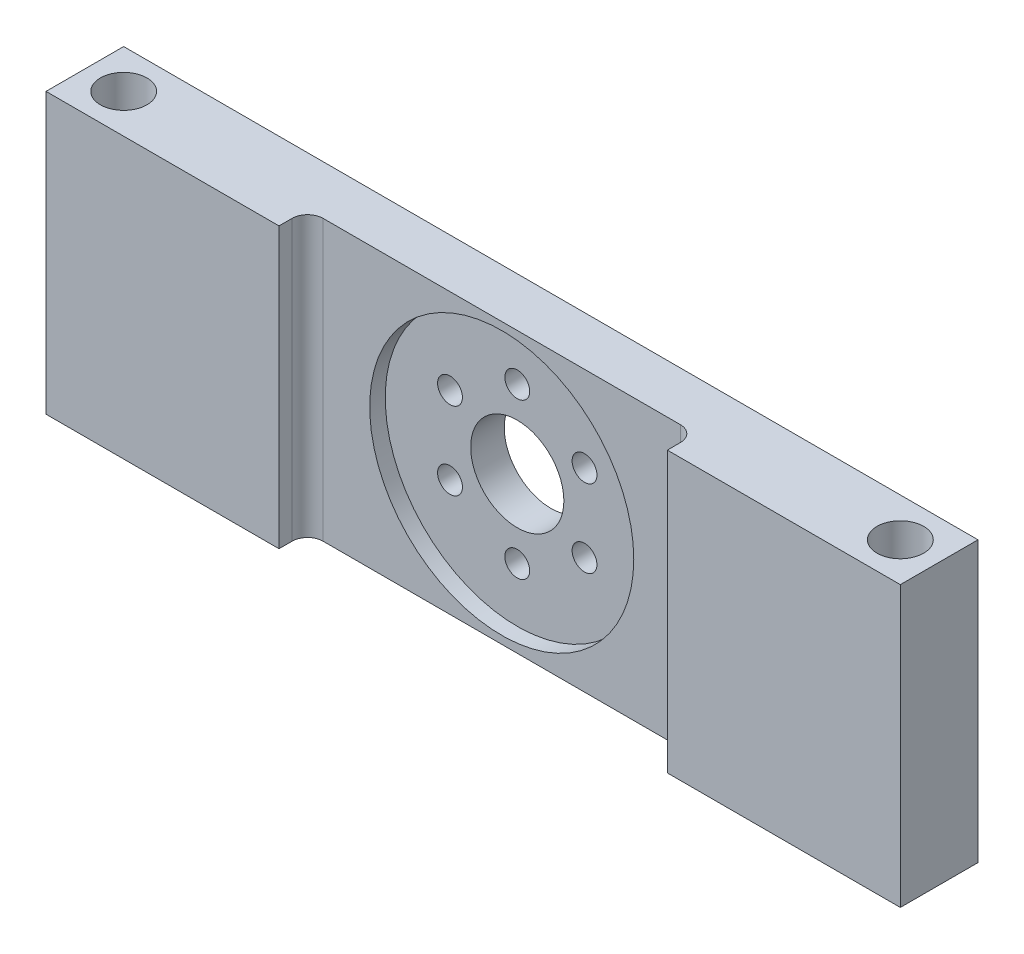
ISO-10303-21;
HEADER;
FILE_DESCRIPTION(('STEP AP214'),'2;1');
FILE_NAME('part.step','',(''),(''),'','','');
FILE_SCHEMA(('AUTOMOTIVE_DESIGN { 1 0 10303 214 1 1 1 1 }'));
ENDSEC;
DATA;
#1=APPLICATION_CONTEXT('core data for automotive mechanical design processes');
#2=APPLICATION_PROTOCOL_DEFINITION('international standard','automotive_design',2000,#1);
#3=PRODUCT_CONTEXT('',#1,'mechanical');
#4=PRODUCT('Part','Part','',(#3));
#5=PRODUCT_RELATED_PRODUCT_CATEGORY('part','',(#4));
#6=PRODUCT_DEFINITION_FORMATION('','',#4);
#7=PRODUCT_DEFINITION_CONTEXT('part definition',#1,'design');
#8=PRODUCT_DEFINITION('design','',#6,#7);
#9=PRODUCT_DEFINITION_SHAPE('','',#8);
#10=(LENGTH_UNIT() NAMED_UNIT(*) SI_UNIT(.MILLI.,.METRE.));
#11=(NAMED_UNIT(*) PLANE_ANGLE_UNIT() SI_UNIT($,.RADIAN.));
#12=(NAMED_UNIT(*) SI_UNIT($,.STERADIAN.) SOLID_ANGLE_UNIT());
#13=UNCERTAINTY_MEASURE_WITH_UNIT(LENGTH_MEASURE(1.E-05),#10,'distance_accuracy_value','');
#14=(GEOMETRIC_REPRESENTATION_CONTEXT(3) GLOBAL_UNCERTAINTY_ASSIGNED_CONTEXT((#13)) GLOBAL_UNIT_ASSIGNED_CONTEXT((#10,
#11,#12)) REPRESENTATION_CONTEXT('',''));
#15=CARTESIAN_POINT('',(0.,0.,0.));
#16=DIRECTION('',(0.,0.,1.));
#17=DIRECTION('',(1.,0.,0.));
#18=AXIS2_PLACEMENT_3D('',#15,#16,#17);
#19=CARTESIAN_POINT('',(-18.9402241321518,18.,1.83898670067009));
#20=DIRECTION('',(-1.,0.,0.));
#21=DIRECTION('',(0.,0.,1.));
#22=AXIS2_PLACEMENT_3D('',#19,#20,#21);
#23=PLANE('',#22);
#24=DIRECTION('',(0.,0.,-1.));
#25=VECTOR('',#24,1.);
#26=CARTESIAN_POINT('',(-18.9402241321518,0.,1.83898670067009));
#27=LINE('',#26,#25);
#28=CARTESIAN_POINT('',(-18.9402241321518,0.,1.83898670067009));
#29=VERTEX_POINT('',#28);
#30=CARTESIAN_POINT('',(-18.9402241321518,0.,-3.16101329932991));
#31=VERTEX_POINT('',#30);
#32=EDGE_CURVE('E137',#29,#31,#27,.T.);
#33=ORIENTED_EDGE('',*,*,#32,.T.);
#34=DIRECTION('',(0.,-1.,0.));
#35=VECTOR('',#34,1.);
#36=CARTESIAN_POINT('',(-18.9402241321518,18.,-3.16101329932991));
#37=LINE('',#36,#35);
#38=CARTESIAN_POINT('',(-18.9402241321518,18.,-3.16101329932991));
#39=VERTEX_POINT('',#38);
#40=EDGE_CURVE('E118',#39,#31,#37,.T.);
#41=ORIENTED_EDGE('',*,*,#40,.F.);
#42=DIRECTION('',(0.,0.,-1.));
#43=VECTOR('',#42,1.);
#44=CARTESIAN_POINT('',(-18.9402241321518,18.,1.83898670067009));
#45=LINE('',#44,#43);
#46=CARTESIAN_POINT('',(-18.9402241321518,18.,1.83898670067009));
#47=VERTEX_POINT('',#46);
#48=EDGE_CURVE('E125',#47,#39,#45,.T.);
#49=ORIENTED_EDGE('',*,*,#48,.F.);
#50=DIRECTION('',(0.,-1.,0.));
#51=VECTOR('',#50,1.);
#52=CARTESIAN_POINT('',(-18.9402241321518,18.,1.83898670067009));
#53=LINE('',#52,#51);
#54=EDGE_CURVE('E188',#47,#29,#53,.T.);
#55=ORIENTED_EDGE('',*,*,#54,.T.);
#56=EDGE_LOOP('',(#33,#41,#49,#55));
#57=FACE_BOUND('',#56,.T.);
#58=ADVANCED_FACE('F37',(#57),#23,.F.);
#59=CARTESIAN_POINT('',(-73.9402241321518,18.,-3.16101329932991));
#60=DIRECTION('',(0.,0.,1.));
#61=DIRECTION('',(1.,0.,0.));
#62=AXIS2_PLACEMENT_3D('',#59,#60,#61);
#63=PLANE('',#62);
#64=CARTESIAN_POINT('',(-50.7703511510739,11.4999999999999,-3.16101329932991));
#65=DIRECTION('',(0.,0.,1.));
#66=DIRECTION('',(1.,0.,0.));
#67=AXIS2_PLACEMENT_3D('',#64,#65,#66);
#68=CIRCLE('',#67,0.800000000000006);
#69=CARTESIAN_POINT('',(-49.9703511510739,11.4999999999999,-3.16101329932991));
#70=VERTEX_POINT('',#69);
#71=EDGE_CURVE('E258',#70,#70,#68,.T.);
#72=ORIENTED_EDGE('',*,*,#71,.T.);
#73=EDGE_LOOP('',(#72));
#74=FACE_BOUND('',#73,.T.);
#75=CARTESIAN_POINT('',(-50.7703511510737,6.49999999999985,-3.16101329932991));
#76=DIRECTION('',(0.,0.,1.));
#77=DIRECTION('',(1.,0.,0.));
#78=AXIS2_PLACEMENT_3D('',#75,#76,#77);
#79=CIRCLE('',#78,0.800000000000005);
#80=CARTESIAN_POINT('',(-49.9703511510737,6.49999999999985,-3.16101329932991));
#81=VERTEX_POINT('',#80);
#82=EDGE_CURVE('E252',#81,#81,#79,.T.);
#83=ORIENTED_EDGE('',*,*,#82,.T.);
#84=EDGE_LOOP('',(#83));
#85=FACE_BOUND('',#84,.T.);
#86=CARTESIAN_POINT('',(-46.4402241321515,4.,-3.16101329932991));
#87=DIRECTION('',(0.,0.,1.));
#88=DIRECTION('',(1.,0.,0.));
#89=AXIS2_PLACEMENT_3D('',#86,#87,#88);
#90=CIRCLE('',#89,0.800000000000001);
#91=CARTESIAN_POINT('',(-45.6402241321515,4.,-3.16101329932991));
#92=VERTEX_POINT('',#91);
#93=EDGE_CURVE('E246',#92,#92,#90,.T.);
#94=ORIENTED_EDGE('',*,*,#93,.T.);
#95=EDGE_LOOP('',(#94));
#96=FACE_BOUND('',#95,.T.);
#97=CARTESIAN_POINT('',(-42.1100971132294,6.50000000000017,-3.16101329932991));
#98=DIRECTION('',(0.,0.,1.));
#99=DIRECTION('',(1.,0.,0.));
#100=AXIS2_PLACEMENT_3D('',#97,#98,#99);
#101=CIRCLE('',#100,0.800000000000004);
#102=CARTESIAN_POINT('',(-41.3100971132294,6.50000000000017,-3.16101329932991));
#103=VERTEX_POINT('',#102);
#104=EDGE_CURVE('E240',#103,#103,#101,.T.);
#105=ORIENTED_EDGE('',*,*,#104,.T.);
#106=EDGE_LOOP('',(#105));
#107=FACE_BOUND('',#106,.T.);
#108=CARTESIAN_POINT('',(-42.1100971132295,11.5000000000002,-3.16101329932991));
#109=DIRECTION('',(0.,0.,1.));
#110=DIRECTION('',(1.,0.,0.));
#111=AXIS2_PLACEMENT_3D('',#108,#109,#110);
#112=CIRCLE('',#111,0.800000000000005);
#113=CARTESIAN_POINT('',(-41.3100971132295,11.5000000000002,-3.16101329932991));
#114=VERTEX_POINT('',#113);
#115=EDGE_CURVE('E234',#114,#114,#112,.T.);
#116=ORIENTED_EDGE('',*,*,#115,.T.);
#117=EDGE_LOOP('',(#116));
#118=FACE_BOUND('',#117,.T.);
#119=CARTESIAN_POINT('',(-46.4402241321518,14.,-3.16101329932991));
#120=DIRECTION('',(0.,0.,1.));
#121=DIRECTION('',(1.,0.,0.));
#122=AXIS2_PLACEMENT_3D('',#119,#120,#121);
#123=CIRCLE('',#122,0.800000000000002);
#124=CARTESIAN_POINT('',(-45.6402241321518,14.,-3.16101329932991));
#125=VERTEX_POINT('',#124);
#126=EDGE_CURVE('E225',#125,#125,#123,.T.);
#127=ORIENTED_EDGE('',*,*,#126,.T.);
#128=EDGE_LOOP('',(#127));
#129=FACE_BOUND('',#128,.T.);
#130=CARTESIAN_POINT('',(-46.4402241321518,9.,-3.16101329932991));
#131=DIRECTION('',(0.,0.,1.));
#132=DIRECTION('',(1.,0.,0.));
#133=AXIS2_PLACEMENT_3D('',#130,#131,#132);
#134=CIRCLE('',#133,3.);
#135=CARTESIAN_POINT('',(-43.4402241321518,9.,-3.16101329932991));
#136=VERTEX_POINT('',#135);
#137=EDGE_CURVE('E219',#136,#136,#134,.T.);
#138=ORIENTED_EDGE('',*,*,#137,.T.);
#139=EDGE_LOOP('',(#138));
#140=FACE_BOUND('',#139,.T.);
#141=DIRECTION('',(-1.,0.,0.));
#142=VECTOR('',#141,1.);
#143=CARTESIAN_POINT('',(-73.9402241321518,0.,-3.16101329932991));
#144=LINE('',#143,#142);
#145=CARTESIAN_POINT('',(-73.9402241321518,0.,-3.16101329932991));
#146=VERTEX_POINT('',#145);
#147=EDGE_CURVE('E204',#31,#146,#144,.T.);
#148=ORIENTED_EDGE('',*,*,#147,.T.);
#149=DIRECTION('',(0.,-1.,0.));
#150=VECTOR('',#149,1.);
#151=CARTESIAN_POINT('',(-73.9402241321518,18.,-3.16101329932991));
#152=LINE('',#151,#150);
#153=CARTESIAN_POINT('',(-73.9402241321518,18.,-3.16101329932991));
#154=VERTEX_POINT('',#153);
#155=EDGE_CURVE('E121',#154,#146,#152,.T.);
#156=ORIENTED_EDGE('',*,*,#155,.F.);
#157=DIRECTION('',(-1.,0.,0.));
#158=VECTOR('',#157,1.);
#159=CARTESIAN_POINT('',(-73.9402241321518,18.,-3.16101329932991));
#160=LINE('',#159,#158);
#161=EDGE_CURVE('E114',#39,#154,#160,.T.);
#162=ORIENTED_EDGE('',*,*,#161,.F.);
#163=ORIENTED_EDGE('',*,*,#40,.T.);
#164=EDGE_LOOP('',(#148,#156,#162,#163));
#165=FACE_BOUND('',#164,.T.);
#166=ADVANCED_FACE('F116',(#74,#85,#96,#107,#118,#129,#140,#165),#63,.F.);
#167=CARTESIAN_POINT('',(-73.9402241321518,18.,1.83898670067009));
#168=DIRECTION('',(1.,0.,0.));
#169=DIRECTION('',(0.,0.,-1.));
#170=AXIS2_PLACEMENT_3D('',#167,#168,#169);
#171=PLANE('',#170);
#172=DIRECTION('',(0.,0.,1.));
#173=VECTOR('',#172,1.);
#174=CARTESIAN_POINT('',(-73.9402241321518,0.,1.83898670067009));
#175=LINE('',#174,#173);
#176=CARTESIAN_POINT('',(-73.9402241321518,0.,1.83898670067009));
#177=VERTEX_POINT('',#176);
#178=EDGE_CURVE('E203',#146,#177,#175,.T.);
#179=ORIENTED_EDGE('',*,*,#178,.T.);
#180=DIRECTION('',(0.,-1.,0.));
#181=VECTOR('',#180,1.);
#182=CARTESIAN_POINT('',(-73.9402241321518,18.,1.83898670067009));
#183=LINE('',#182,#181);
#184=CARTESIAN_POINT('',(-73.9402241321518,18.,1.83898670067009));
#185=VERTEX_POINT('',#184);
#186=EDGE_CURVE('E143',#185,#177,#183,.T.);
#187=ORIENTED_EDGE('',*,*,#186,.F.);
#188=DIRECTION('',(0.,0.,1.));
#189=VECTOR('',#188,1.);
#190=CARTESIAN_POINT('',(-73.9402241321518,18.,1.83898670067009));
#191=LINE('',#190,#189);
#192=EDGE_CURVE('E124',#154,#185,#191,.T.);
#193=ORIENTED_EDGE('',*,*,#192,.F.);
#194=ORIENTED_EDGE('',*,*,#155,.T.);
#195=EDGE_LOOP('',(#179,#187,#193,#194));
#196=FACE_BOUND('',#195,.T.);
#197=ADVANCED_FACE('F305',(#196),#171,.F.);
#198=CARTESIAN_POINT('',(-73.9402241321518,18.,1.83898670067009));
#199=DIRECTION('',(0.,0.,-1.));
#200=DIRECTION('',(-1.,0.,0.));
#201=AXIS2_PLACEMENT_3D('',#198,#199,#200);
#202=PLANE('',#201);
#203=DIRECTION('',(1.,0.,0.));
#204=VECTOR('',#203,1.);
#205=CARTESIAN_POINT('',(-73.9402241321518,0.,1.83898670067009));
#206=LINE('',#205,#204);
#207=CARTESIAN_POINT('',(-58.9402241321518,0.,1.83898670067009));
#208=VERTEX_POINT('',#207);
#209=EDGE_CURVE('E183',#177,#208,#206,.T.);
#210=ORIENTED_EDGE('',*,*,#209,.T.);
#211=DIRECTION('',(0.,-1.,0.));
#212=VECTOR('',#211,1.);
#213=CARTESIAN_POINT('',(-58.9402241321518,18.,1.83898670067009));
#214=LINE('',#213,#212);
#215=CARTESIAN_POINT('',(-58.9402241321518,18.,1.83898670067009));
#216=VERTEX_POINT('',#215);
#217=EDGE_CURVE('E191',#216,#208,#214,.T.);
#218=ORIENTED_EDGE('',*,*,#217,.F.);
#219=DIRECTION('',(1.,0.,0.));
#220=VECTOR('',#219,1.);
#221=CARTESIAN_POINT('',(-73.9402241321518,18.,1.83898670067009));
#222=LINE('',#221,#220);
#223=EDGE_CURVE('E200',#185,#216,#222,.T.);
#224=ORIENTED_EDGE('',*,*,#223,.F.);
#225=ORIENTED_EDGE('',*,*,#186,.T.);
#226=EDGE_LOOP('',(#210,#218,#224,#225));
#227=FACE_BOUND('',#226,.T.);
#228=ADVANCED_FACE('F198',(#227),#202,.F.);
#229=CARTESIAN_POINT('',(-58.9402241321518,18.,1.83898670067009));
#230=DIRECTION('',(-1.,0.,0.));
#231=DIRECTION('',(0.,0.,1.));
#232=AXIS2_PLACEMENT_3D('',#229,#230,#231);
#233=PLANE('',#232);
#234=DIRECTION('',(0.,0.,-1.));
#235=VECTOR('',#234,1.);
#236=CARTESIAN_POINT('',(-58.9402241321518,0.,1.83898670067009));
#237=LINE('',#236,#235);
#238=CARTESIAN_POINT('',(-58.9402241321518,0.,1.));
#239=VERTEX_POINT('',#238);
#240=EDGE_CURVE('E180',#208,#239,#237,.T.);
#241=ORIENTED_EDGE('',*,*,#240,.T.);
#242=DIRECTION('',(0.,-1.,0.));
#243=VECTOR('',#242,1.);
#244=CARTESIAN_POINT('',(-58.9402241321518,18.,1.));
#245=LINE('',#244,#243);
#246=CARTESIAN_POINT('',(-58.9402241321518,18.,1.));
#247=VERTEX_POINT('',#246);
#248=EDGE_CURVE('E52',#239,#247,#245,.F.);
#249=ORIENTED_EDGE('',*,*,#248,.T.);
#250=DIRECTION('',(0.,0.,-1.));
#251=VECTOR('',#250,1.);
#252=CARTESIAN_POINT('',(-58.9402241321518,18.,1.83898670067009));
#253=LINE('',#252,#251);
#254=EDGE_CURVE('E212',#216,#247,#253,.T.);
#255=ORIENTED_EDGE('',*,*,#254,.F.);
#256=ORIENTED_EDGE('',*,*,#217,.T.);
#257=EDGE_LOOP('',(#241,#249,#255,#256));
#258=FACE_BOUND('',#257,.T.);
#259=ADVANCED_FACE('F361',(#258),#233,.F.);
#260=CARTESIAN_POINT('',(-58.9402241321518,18.,0.));
#261=DIRECTION('',(0.,0.,-1.));
#262=DIRECTION('',(-1.,0.,0.));
#263=AXIS2_PLACEMENT_3D('',#260,#261,#262);
#264=PLANE('',#263);
#265=CARTESIAN_POINT('',(-46.4402241321518,9.,0.));
#266=DIRECTION('',(0.,0.,1.));
#267=DIRECTION('',(1.,0.,0.));
#268=AXIS2_PLACEMENT_3D('',#265,#266,#267);
#269=CIRCLE('',#268,8.5);
#270=CARTESIAN_POINT('',(-37.9402241321519,9.,0.));
#271=VERTEX_POINT('',#270);
#272=EDGE_CURVE('E216',#271,#271,#269,.T.);
#273=ORIENTED_EDGE('',*,*,#272,.F.);
#274=EDGE_LOOP('',(#273));
#275=FACE_BOUND('',#274,.T.);
#276=DIRECTION('',(1.,0.,0.));
#277=VECTOR('',#276,1.);
#278=CARTESIAN_POINT('',(-58.9402241321518,0.,0.));
#279=LINE('',#278,#277);
#280=CARTESIAN_POINT('',(-57.9402241321518,0.,0.));
#281=VERTEX_POINT('',#280);
#282=CARTESIAN_POINT('',(-34.9402241321518,0.,0.));
#283=VERTEX_POINT('',#282);
#284=EDGE_CURVE('E174',#281,#283,#279,.T.);
#285=ORIENTED_EDGE('',*,*,#284,.T.);
#286=DIRECTION('',(0.,-1.,0.));
#287=VECTOR('',#286,1.);
#288=CARTESIAN_POINT('',(-34.9402241321518,18.,0.));
#289=LINE('',#288,#287);
#290=CARTESIAN_POINT('',(-34.9402241321518,18.,0.));
#291=VERTEX_POINT('',#290);
#292=EDGE_CURVE('E149',#283,#291,#289,.F.);
#293=ORIENTED_EDGE('',*,*,#292,.T.);
#294=DIRECTION('',(1.,0.,0.));
#295=VECTOR('',#294,1.);
#296=CARTESIAN_POINT('',(-58.9402241321518,18.,0.));
#297=LINE('',#296,#295);
#298=CARTESIAN_POINT('',(-57.9402241321518,18.,0.));
#299=VERTEX_POINT('',#298);
#300=EDGE_CURVE('E161',#299,#291,#297,.T.);
#301=ORIENTED_EDGE('',*,*,#300,.F.);
#302=DIRECTION('',(0.,-1.,0.));
#303=VECTOR('',#302,1.);
#304=CARTESIAN_POINT('',(-57.9402241321518,0.,0.));
#305=LINE('',#304,#303);
#306=EDGE_CURVE('E141',#299,#281,#305,.T.);
#307=ORIENTED_EDGE('',*,*,#306,.T.);
#308=EDGE_LOOP('',(#285,#293,#301,#307));
#309=FACE_BOUND('',#308,.T.);
#310=ADVANCED_FACE('F178',(#275,#309),#264,.F.);
#311=CARTESIAN_POINT('',(-33.9402241321518,18.,1.83898670067009));
#312=DIRECTION('',(1.,0.,0.));
#313=DIRECTION('',(0.,0.,-1.));
#314=AXIS2_PLACEMENT_3D('',#311,#312,#313);
#315=PLANE('',#314);
#316=DIRECTION('',(0.,0.,1.));
#317=VECTOR('',#316,1.);
#318=CARTESIAN_POINT('',(-33.9402241321518,18.,1.83898670067009));
#319=LINE('',#318,#317);
#320=CARTESIAN_POINT('',(-33.9402241321518,18.,1.));
#321=VERTEX_POINT('',#320);
#322=CARTESIAN_POINT('',(-33.9402241321518,18.,1.83898670067009));
#323=VERTEX_POINT('',#322);
#324=EDGE_CURVE('E158',#321,#323,#319,.T.);
#325=ORIENTED_EDGE('',*,*,#324,.F.);
#326=DIRECTION('',(0.,-1.,0.));
#327=VECTOR('',#326,1.);
#328=CARTESIAN_POINT('',(-33.9402241321518,0.,1.));
#329=LINE('',#328,#327);
#330=CARTESIAN_POINT('',(-33.9402241321518,0.,1.));
#331=VERTEX_POINT('',#330);
#332=EDGE_CURVE('E138',#321,#331,#329,.T.);
#333=ORIENTED_EDGE('',*,*,#332,.T.);
#334=DIRECTION('',(0.,0.,1.));
#335=VECTOR('',#334,1.);
#336=CARTESIAN_POINT('',(-33.9402241321518,0.,1.83898670067009));
#337=LINE('',#336,#335);
#338=CARTESIAN_POINT('',(-33.9402241321518,0.,1.83898670067009));
#339=VERTEX_POINT('',#338);
#340=EDGE_CURVE('E176',#331,#339,#337,.T.);
#341=ORIENTED_EDGE('',*,*,#340,.T.);
#342=DIRECTION('',(0.,-1.,0.));
#343=VECTOR('',#342,1.);
#344=CARTESIAN_POINT('',(-33.9402241321518,18.,1.83898670067009));
#345=LINE('',#344,#343);
#346=EDGE_CURVE('E169',#323,#339,#345,.T.);
#347=ORIENTED_EDGE('',*,*,#346,.F.);
#348=EDGE_LOOP('',(#325,#333,#341,#347));
#349=FACE_BOUND('',#348,.T.);
#350=ADVANCED_FACE('F166',(#349),#315,.F.);
#351=CARTESIAN_POINT('',(-33.9402241321518,18.,1.83898670067009));
#352=DIRECTION('',(0.,0.,-1.));
#353=DIRECTION('',(-1.,0.,0.));
#354=AXIS2_PLACEMENT_3D('',#351,#352,#353);
#355=PLANE('',#354);
#356=DIRECTION('',(1.,0.,0.));
#357=VECTOR('',#356,1.);
#358=CARTESIAN_POINT('',(-33.9402241321518,0.,1.83898670067009));
#359=LINE('',#358,#357);
#360=EDGE_CURVE('E134',#339,#29,#359,.T.);
#361=ORIENTED_EDGE('',*,*,#360,.T.);
#362=ORIENTED_EDGE('',*,*,#54,.F.);
#363=DIRECTION('',(1.,0.,0.));
#364=VECTOR('',#363,1.);
#365=CARTESIAN_POINT('',(-33.9402241321518,18.,1.83898670067009));
#366=LINE('',#365,#364);
#367=EDGE_CURVE('E130',#323,#47,#366,.T.);
#368=ORIENTED_EDGE('',*,*,#367,.F.);
#369=ORIENTED_EDGE('',*,*,#346,.T.);
#370=EDGE_LOOP('',(#361,#362,#368,#369));
#371=FACE_BOUND('',#370,.T.);
#372=ADVANCED_FACE('F287',(#371),#355,.F.);
#373=CARTESIAN_POINT('',(0.,18.,0.));
#374=DIRECTION('',(0.,-1.,0.));
#375=DIRECTION('',(0.,0.,-1.));
#376=AXIS2_PLACEMENT_3D('',#373,#374,#375);
#377=PLANE('',#376);
#378=CARTESIAN_POINT('',(-21.4402241321518,18.,-0.661013299329912));
#379=DIRECTION('',(0.,1.,0.));
#380=DIRECTION('',(0.,0.,1.));
#381=AXIS2_PLACEMENT_3D('',#378,#379,#380);
#382=CIRCLE('',#381,1.5);
#383=CARTESIAN_POINT('',(-21.4402241321518,18.,0.838986700670089));
#384=VERTEX_POINT('',#383);
#385=EDGE_CURVE('E270',#384,#384,#382,.T.);
#386=ORIENTED_EDGE('',*,*,#385,.F.);
#387=EDGE_LOOP('',(#386));
#388=FACE_BOUND('',#387,.T.);
#389=CARTESIAN_POINT('',(-71.4402241321518,18.,-0.661013299329912));
#390=DIRECTION('',(0.,1.,0.));
#391=DIRECTION('',(0.,0.,1.));
#392=AXIS2_PLACEMENT_3D('',#389,#390,#391);
#393=CIRCLE('',#392,1.5);
#394=CARTESIAN_POINT('',(-71.4402241321518,18.,0.838986700670085));
#395=VERTEX_POINT('',#394);
#396=EDGE_CURVE('E264',#395,#395,#393,.T.);
#397=ORIENTED_EDGE('',*,*,#396,.F.);
#398=EDGE_LOOP('',(#397));
#399=FACE_BOUND('',#398,.T.);
#400=ORIENTED_EDGE('',*,*,#48,.T.);
#401=ORIENTED_EDGE('',*,*,#161,.T.);
#402=ORIENTED_EDGE('',*,*,#192,.T.);
#403=ORIENTED_EDGE('',*,*,#223,.T.);
#404=ORIENTED_EDGE('',*,*,#254,.T.);
#405=CARTESIAN_POINT('',(-57.9402241321518,18.,1.));
#406=DIRECTION('',(0.,-1.,0.));
#407=DIRECTION('',(0.,0.,-1.));
#408=AXIS2_PLACEMENT_3D('',#405,#406,#407);
#409=CIRCLE('',#408,1.);
#410=EDGE_CURVE('E11',#247,#299,#409,.T.);
#411=ORIENTED_EDGE('',*,*,#410,.T.);
#412=ORIENTED_EDGE('',*,*,#300,.T.);
#413=CARTESIAN_POINT('',(-34.9402241321518,18.,1.));
#414=DIRECTION('',(0.,-1.,0.));
#415=DIRECTION('',(0.,0.,-1.));
#416=AXIS2_PLACEMENT_3D('',#413,#414,#415);
#417=CIRCLE('',#416,1.);
#418=EDGE_CURVE('E154',#291,#321,#417,.T.);
#419=ORIENTED_EDGE('',*,*,#418,.T.);
#420=ORIENTED_EDGE('',*,*,#324,.T.);
#421=ORIENTED_EDGE('',*,*,#367,.T.);
#422=EDGE_LOOP('',(#400,#401,#402,#403,#404,#411,#412,#419,#420,#421));
#423=FACE_BOUND('',#422,.T.);
#424=ADVANCED_FACE('F128',(#388,#399,#423),#377,.F.);
#425=CARTESIAN_POINT('',(0.,0.,0.));
#426=DIRECTION('',(0.,-1.,0.));
#427=DIRECTION('',(0.,0.,-1.));
#428=AXIS2_PLACEMENT_3D('',#425,#426,#427);
#429=PLANE('',#428);
#430=CARTESIAN_POINT('',(-21.4402241321518,0.,-0.661013299329912));
#431=DIRECTION('',(0.,1.,0.));
#432=DIRECTION('',(0.,0.,1.));
#433=AXIS2_PLACEMENT_3D('',#430,#431,#432);
#434=CIRCLE('',#433,1.5);
#435=CARTESIAN_POINT('',(-21.4402241321518,0.,0.838986700670089));
#436=VERTEX_POINT('',#435);
#437=EDGE_CURVE('E267',#436,#436,#434,.T.);
#438=ORIENTED_EDGE('',*,*,#437,.T.);
#439=EDGE_LOOP('',(#438));
#440=FACE_BOUND('',#439,.T.);
#441=CARTESIAN_POINT('',(-71.4402241321518,0.,-0.661013299329912));
#442=DIRECTION('',(0.,1.,0.));
#443=DIRECTION('',(0.,0.,1.));
#444=AXIS2_PLACEMENT_3D('',#441,#442,#443);
#445=CIRCLE('',#444,1.5);
#446=CARTESIAN_POINT('',(-71.4402241321518,0.,0.838986700670085));
#447=VERTEX_POINT('',#446);
#448=EDGE_CURVE('E261',#447,#447,#445,.T.);
#449=ORIENTED_EDGE('',*,*,#448,.T.);
#450=EDGE_LOOP('',(#449));
#451=FACE_BOUND('',#450,.T.);
#452=ORIENTED_EDGE('',*,*,#32,.F.);
#453=ORIENTED_EDGE('',*,*,#360,.F.);
#454=ORIENTED_EDGE('',*,*,#340,.F.);
#455=CARTESIAN_POINT('',(-34.9402241321518,0.,1.));
#456=DIRECTION('',(0.,-1.,0.));
#457=DIRECTION('',(0.,0.,-1.));
#458=AXIS2_PLACEMENT_3D('',#455,#456,#457);
#459=CIRCLE('',#458,1.);
#460=EDGE_CURVE('E152',#331,#283,#459,.F.);
#461=ORIENTED_EDGE('',*,*,#460,.T.);
#462=ORIENTED_EDGE('',*,*,#284,.F.);
#463=CARTESIAN_POINT('',(-57.9402241321518,0.,1.));
#464=DIRECTION('',(0.,-1.,0.));
#465=DIRECTION('',(0.,0.,-1.));
#466=AXIS2_PLACEMENT_3D('',#463,#464,#465);
#467=CIRCLE('',#466,1.);
#468=EDGE_CURVE('E45',#281,#239,#467,.F.);
#469=ORIENTED_EDGE('',*,*,#468,.T.);
#470=ORIENTED_EDGE('',*,*,#240,.F.);
#471=ORIENTED_EDGE('',*,*,#209,.F.);
#472=ORIENTED_EDGE('',*,*,#178,.F.);
#473=ORIENTED_EDGE('',*,*,#147,.F.);
#474=EDGE_LOOP('',(#452,#453,#454,#461,#462,#469,#470,#471,#472,#473));
#475=FACE_BOUND('',#474,.T.);
#476=ADVANCED_FACE('F173',(#440,#451,#475),#429,.T.);
#477=CARTESIAN_POINT('',(-46.4402241321518,9.,-1.));
#478=DIRECTION('',(0.,0.,1.));
#479=DIRECTION('',(1.,0.,0.));
#480=AXIS2_PLACEMENT_3D('',#477,#478,#479);
#481=CYLINDRICAL_SURFACE('',#480,8.5);
#482=CARTESIAN_POINT('',(-46.4402241321518,9.,-1.));
#483=DIRECTION('',(0.,0.,1.));
#484=DIRECTION('',(1.,0.,0.));
#485=AXIS2_PLACEMENT_3D('',#482,#483,#484);
#486=CIRCLE('',#485,8.5);
#487=CARTESIAN_POINT('',(-37.9402241321519,9.,-1.));
#488=VERTEX_POINT('',#487);
#489=EDGE_CURVE('E209',#488,#488,#486,.T.);
#490=ORIENTED_EDGE('',*,*,#489,.F.);
#491=EDGE_LOOP('',(#490));
#492=FACE_BOUND('',#491,.T.);
#493=ORIENTED_EDGE('',*,*,#272,.T.);
#494=EDGE_LOOP('',(#493));
#495=FACE_BOUND('',#494,.T.);
#496=ADVANCED_FACE('F347',(#492,#495),#481,.F.);
#497=CARTESIAN_POINT('',(-46.4402241321518,9.,-1.));
#498=DIRECTION('',(0.,0.,1.));
#499=DIRECTION('',(1.,0.,0.));
#500=AXIS2_PLACEMENT_3D('',#497,#498,#499);
#501=PLANE('',#500);
#502=CARTESIAN_POINT('',(-50.7703511510739,11.4999999999999,-1.));
#503=DIRECTION('',(0.,0.,1.));
#504=DIRECTION('',(1.,0.,0.));
#505=AXIS2_PLACEMENT_3D('',#502,#503,#504);
#506=CIRCLE('',#505,0.800000000000006);
#507=CARTESIAN_POINT('',(-49.9703511510739,11.4999999999999,-1.));
#508=VERTEX_POINT('',#507);
#509=EDGE_CURVE('E255',#508,#508,#506,.T.);
#510=ORIENTED_EDGE('',*,*,#509,.F.);
#511=EDGE_LOOP('',(#510));
#512=FACE_BOUND('',#511,.T.);
#513=CARTESIAN_POINT('',(-50.7703511510737,6.49999999999985,-1.));
#514=DIRECTION('',(0.,0.,1.));
#515=DIRECTION('',(1.,0.,0.));
#516=AXIS2_PLACEMENT_3D('',#513,#514,#515);
#517=CIRCLE('',#516,0.800000000000005);
#518=CARTESIAN_POINT('',(-49.9703511510737,6.49999999999985,-1.));
#519=VERTEX_POINT('',#518);
#520=EDGE_CURVE('E249',#519,#519,#517,.T.);
#521=ORIENTED_EDGE('',*,*,#520,.F.);
#522=EDGE_LOOP('',(#521));
#523=FACE_BOUND('',#522,.T.);
#524=CARTESIAN_POINT('',(-46.4402241321515,4.,-1.));
#525=DIRECTION('',(0.,0.,1.));
#526=DIRECTION('',(1.,0.,0.));
#527=AXIS2_PLACEMENT_3D('',#524,#525,#526);
#528=CIRCLE('',#527,0.800000000000001);
#529=CARTESIAN_POINT('',(-45.6402241321515,4.,-1.));
#530=VERTEX_POINT('',#529);
#531=EDGE_CURVE('E243',#530,#530,#528,.T.);
#532=ORIENTED_EDGE('',*,*,#531,.F.);
#533=EDGE_LOOP('',(#532));
#534=FACE_BOUND('',#533,.T.);
#535=CARTESIAN_POINT('',(-42.1100971132294,6.50000000000017,-1.));
#536=DIRECTION('',(0.,0.,1.));
#537=DIRECTION('',(1.,0.,0.));
#538=AXIS2_PLACEMENT_3D('',#535,#536,#537);
#539=CIRCLE('',#538,0.800000000000004);
#540=CARTESIAN_POINT('',(-41.3100971132294,6.50000000000017,-1.));
#541=VERTEX_POINT('',#540);
#542=EDGE_CURVE('E237',#541,#541,#539,.T.);
#543=ORIENTED_EDGE('',*,*,#542,.F.);
#544=EDGE_LOOP('',(#543));
#545=FACE_BOUND('',#544,.T.);
#546=CARTESIAN_POINT('',(-42.1100971132295,11.5000000000002,-1.));
#547=DIRECTION('',(0.,0.,1.));
#548=DIRECTION('',(1.,0.,0.));
#549=AXIS2_PLACEMENT_3D('',#546,#547,#548);
#550=CIRCLE('',#549,0.800000000000005);
#551=CARTESIAN_POINT('',(-41.3100971132295,11.5000000000002,-1.));
#552=VERTEX_POINT('',#551);
#553=EDGE_CURVE('E231',#552,#552,#550,.T.);
#554=ORIENTED_EDGE('',*,*,#553,.F.);
#555=EDGE_LOOP('',(#554));
#556=FACE_BOUND('',#555,.T.);
#557=CARTESIAN_POINT('',(-46.4402241321518,14.,-1.));
#558=DIRECTION('',(0.,0.,1.));
#559=DIRECTION('',(1.,0.,0.));
#560=AXIS2_PLACEMENT_3D('',#557,#558,#559);
#561=CIRCLE('',#560,0.800000000000002);
#562=CARTESIAN_POINT('',(-45.6402241321518,14.,-1.));
#563=VERTEX_POINT('',#562);
#564=EDGE_CURVE('E228',#563,#563,#561,.T.);
#565=ORIENTED_EDGE('',*,*,#564,.F.);
#566=EDGE_LOOP('',(#565));
#567=FACE_BOUND('',#566,.T.);
#568=CARTESIAN_POINT('',(-46.4402241321518,9.,-1.));
#569=DIRECTION('',(0.,0.,1.));
#570=DIRECTION('',(1.,0.,0.));
#571=AXIS2_PLACEMENT_3D('',#568,#569,#570);
#572=CIRCLE('',#571,3.);
#573=CARTESIAN_POINT('',(-43.4402241321518,9.,-1.));
#574=VERTEX_POINT('',#573);
#575=EDGE_CURVE('E222',#574,#574,#572,.T.);
#576=ORIENTED_EDGE('',*,*,#575,.F.);
#577=EDGE_LOOP('',(#576));
#578=FACE_BOUND('',#577,.T.);
#579=ORIENTED_EDGE('',*,*,#489,.T.);
#580=EDGE_LOOP('',(#579));
#581=FACE_BOUND('',#580,.T.);
#582=ADVANCED_FACE('F343',(#512,#523,#534,#545,#556,#567,#578,#581),#501,.T.);
#583=CARTESIAN_POINT('',(-46.4402241321518,9.,-3.16101329932991));
#584=DIRECTION('',(0.,0.,1.));
#585=DIRECTION('',(1.,0.,0.));
#586=AXIS2_PLACEMENT_3D('',#583,#584,#585);
#587=CYLINDRICAL_SURFACE('',#586,3.);
#588=ORIENTED_EDGE('',*,*,#137,.F.);
#589=EDGE_LOOP('',(#588));
#590=FACE_BOUND('',#589,.T.);
#591=ORIENTED_EDGE('',*,*,#575,.T.);
#592=EDGE_LOOP('',(#591));
#593=FACE_BOUND('',#592,.T.);
#594=ADVANCED_FACE('F339',(#590,#593),#587,.F.);
#595=CARTESIAN_POINT('',(-46.4402241321518,14.,-3.16101329932991));
#596=DIRECTION('',(0.,0.,1.));
#597=DIRECTION('',(1.,0.,0.));
#598=AXIS2_PLACEMENT_3D('',#595,#596,#597);
#599=CYLINDRICAL_SURFACE('',#598,0.800000000000002);
#600=ORIENTED_EDGE('',*,*,#126,.F.);
#601=EDGE_LOOP('',(#600));
#602=FACE_BOUND('',#601,.T.);
#603=ORIENTED_EDGE('',*,*,#564,.T.);
#604=EDGE_LOOP('',(#603));
#605=FACE_BOUND('',#604,.T.);
#606=ADVANCED_FACE('F335',(#602,#605),#599,.F.);
#607=CARTESIAN_POINT('',(-42.1100971132295,11.5000000000002,-3.16101329932991));
#608=DIRECTION('',(0.,0.,1.));
#609=DIRECTION('',(1.,0.,0.));
#610=AXIS2_PLACEMENT_3D('',#607,#608,#609);
#611=CYLINDRICAL_SURFACE('',#610,0.800000000000005);
#612=ORIENTED_EDGE('',*,*,#115,.F.);
#613=EDGE_LOOP('',(#612));
#614=FACE_BOUND('',#613,.T.);
#615=ORIENTED_EDGE('',*,*,#553,.T.);
#616=EDGE_LOOP('',(#615));
#617=FACE_BOUND('',#616,.T.);
#618=ADVANCED_FACE('F331',(#614,#617),#611,.F.);
#619=CARTESIAN_POINT('',(-42.1100971132294,6.50000000000017,-3.16101329932991));
#620=DIRECTION('',(0.,0.,1.));
#621=DIRECTION('',(1.,0.,0.));
#622=AXIS2_PLACEMENT_3D('',#619,#620,#621);
#623=CYLINDRICAL_SURFACE('',#622,0.800000000000004);
#624=ORIENTED_EDGE('',*,*,#104,.F.);
#625=EDGE_LOOP('',(#624));
#626=FACE_BOUND('',#625,.T.);
#627=ORIENTED_EDGE('',*,*,#542,.T.);
#628=EDGE_LOOP('',(#627));
#629=FACE_BOUND('',#628,.T.);
#630=ADVANCED_FACE('F327',(#626,#629),#623,.F.);
#631=CARTESIAN_POINT('',(-46.4402241321515,4.,-3.16101329932991));
#632=DIRECTION('',(0.,0.,1.));
#633=DIRECTION('',(1.,0.,0.));
#634=AXIS2_PLACEMENT_3D('',#631,#632,#633);
#635=CYLINDRICAL_SURFACE('',#634,0.800000000000001);
#636=ORIENTED_EDGE('',*,*,#93,.F.);
#637=EDGE_LOOP('',(#636));
#638=FACE_BOUND('',#637,.T.);
#639=ORIENTED_EDGE('',*,*,#531,.T.);
#640=EDGE_LOOP('',(#639));
#641=FACE_BOUND('',#640,.T.);
#642=ADVANCED_FACE('F319',(#638,#641),#635,.F.);
#643=CARTESIAN_POINT('',(-50.7703511510737,6.49999999999985,-3.16101329932991));
#644=DIRECTION('',(0.,0.,1.));
#645=DIRECTION('',(1.,0.,0.));
#646=AXIS2_PLACEMENT_3D('',#643,#644,#645);
#647=CYLINDRICAL_SURFACE('',#646,0.800000000000005);
#648=ORIENTED_EDGE('',*,*,#82,.F.);
#649=EDGE_LOOP('',(#648));
#650=FACE_BOUND('',#649,.T.);
#651=ORIENTED_EDGE('',*,*,#520,.T.);
#652=EDGE_LOOP('',(#651));
#653=FACE_BOUND('',#652,.T.);
#654=ADVANCED_FACE('F314',(#650,#653),#647,.F.);
#655=CARTESIAN_POINT('',(-50.7703511510739,11.4999999999999,-3.16101329932991));
#656=DIRECTION('',(0.,0.,1.));
#657=DIRECTION('',(1.,0.,0.));
#658=AXIS2_PLACEMENT_3D('',#655,#656,#657);
#659=CYLINDRICAL_SURFACE('',#658,0.800000000000006);
#660=ORIENTED_EDGE('',*,*,#71,.F.);
#661=EDGE_LOOP('',(#660));
#662=FACE_BOUND('',#661,.T.);
#663=ORIENTED_EDGE('',*,*,#509,.T.);
#664=EDGE_LOOP('',(#663));
#665=FACE_BOUND('',#664,.T.);
#666=ADVANCED_FACE('F310',(#662,#665),#659,.F.);
#667=CARTESIAN_POINT('',(-34.9402241321518,18.,1.));
#668=DIRECTION('',(0.,1.,0.));
#669=DIRECTION('',(0.,0.,1.));
#670=AXIS2_PLACEMENT_3D('',#667,#668,#669);
#671=CYLINDRICAL_SURFACE('',#670,1.);
#672=ORIENTED_EDGE('',*,*,#418,.F.);
#673=ORIENTED_EDGE('',*,*,#292,.F.);
#674=ORIENTED_EDGE('',*,*,#460,.F.);
#675=ORIENTED_EDGE('',*,*,#332,.F.);
#676=EDGE_LOOP('',(#672,#673,#674,#675));
#677=FACE_BOUND('',#676,.T.);
#678=ADVANCED_FACE('F171',(#677),#671,.F.);
#679=CARTESIAN_POINT('',(-57.9402241321518,18.,1.));
#680=DIRECTION('',(0.,1.,0.));
#681=DIRECTION('',(0.,0.,1.));
#682=AXIS2_PLACEMENT_3D('',#679,#680,#681);
#683=CYLINDRICAL_SURFACE('',#682,1.);
#684=ORIENTED_EDGE('',*,*,#410,.F.);
#685=ORIENTED_EDGE('',*,*,#248,.F.);
#686=ORIENTED_EDGE('',*,*,#468,.F.);
#687=ORIENTED_EDGE('',*,*,#306,.F.);
#688=EDGE_LOOP('',(#684,#685,#686,#687));
#689=FACE_BOUND('',#688,.T.);
#690=ADVANCED_FACE('F39',(#689),#683,.F.);
#691=CARTESIAN_POINT('',(-71.4402241321518,0.,-0.661013299329912));
#692=DIRECTION('',(0.,1.,0.));
#693=DIRECTION('',(0.,0.,1.));
#694=AXIS2_PLACEMENT_3D('',#691,#692,#693);
#695=CYLINDRICAL_SURFACE('',#694,1.5);
#696=ORIENTED_EDGE('',*,*,#448,.F.);
#697=EDGE_LOOP('',(#696));
#698=FACE_BOUND('',#697,.T.);
#699=ORIENTED_EDGE('',*,*,#396,.T.);
#700=EDGE_LOOP('',(#699));
#701=FACE_BOUND('',#700,.T.);
#702=ADVANCED_FACE('F281',(#698,#701),#695,.F.);
#703=CARTESIAN_POINT('',(-21.4402241321518,0.,-0.661013299329912));
#704=DIRECTION('',(0.,1.,0.));
#705=DIRECTION('',(0.,0.,1.));
#706=AXIS2_PLACEMENT_3D('',#703,#704,#705);
#707=CYLINDRICAL_SURFACE('',#706,1.5);
#708=ORIENTED_EDGE('',*,*,#437,.F.);
#709=EDGE_LOOP('',(#708));
#710=FACE_BOUND('',#709,.T.);
#711=ORIENTED_EDGE('',*,*,#385,.T.);
#712=EDGE_LOOP('',(#711));
#713=FACE_BOUND('',#712,.T.);
#714=ADVANCED_FACE('F278',(#710,#713),#707,.F.);
#715=CLOSED_SHELL('',(#58,#166,#197,#228,#259,#310,#350,#372,#424,#476,#496,#582,#594,#606,#618,
#630,#642,#654,#666,#678,#690,#702,#714));
#716=MANIFOLD_SOLID_BREP('B2',#715);
#717=ADVANCED_BREP_SHAPE_REPRESENTATION('',(#18,#716),#14);
#718=SHAPE_DEFINITION_REPRESENTATION(#9,#717);
ENDSEC;
END-ISO-10303-21;
